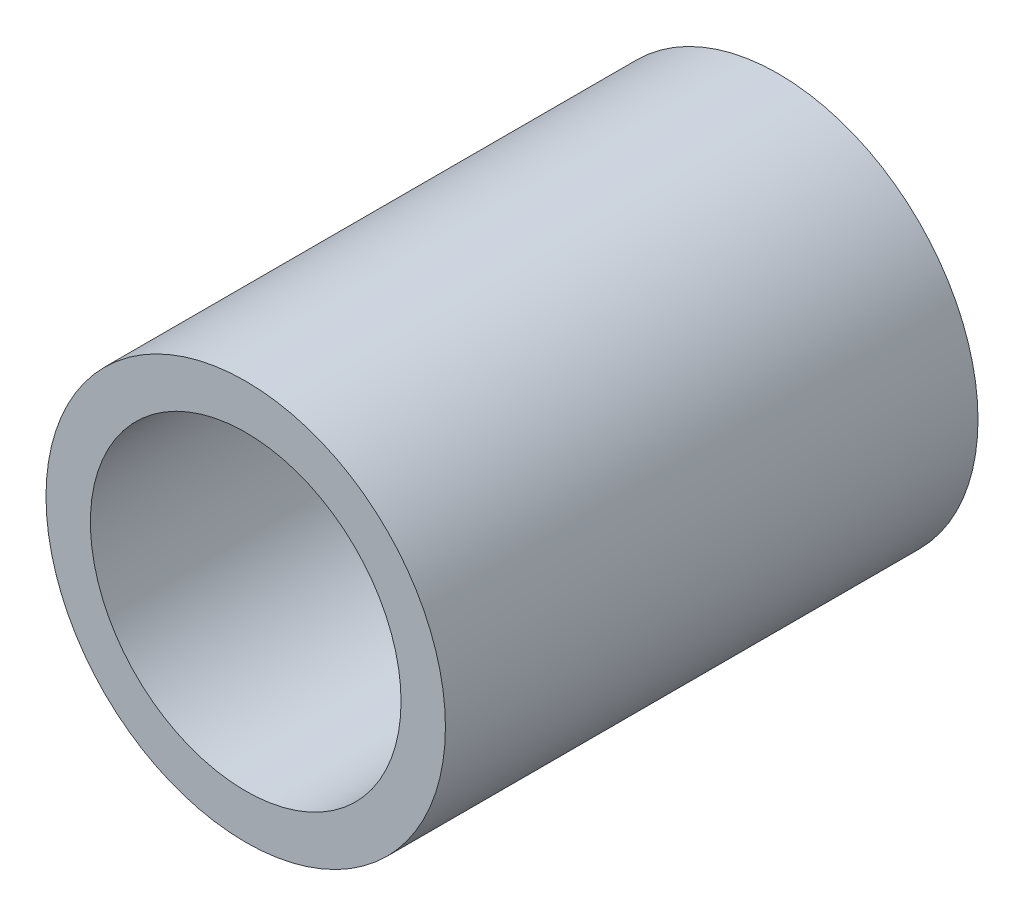
ISO-10303-21;
HEADER;
FILE_DESCRIPTION(('STEP AP214'),'2;1');
FILE_NAME('part.step','',(''),(''),'','','');
FILE_SCHEMA(('AUTOMOTIVE_DESIGN { 1 0 10303 214 1 1 1 1 }'));
ENDSEC;
DATA;
#1=APPLICATION_CONTEXT('core data for automotive mechanical design processes');
#2=APPLICATION_PROTOCOL_DEFINITION('international standard','automotive_design',2000,#1);
#3=PRODUCT_CONTEXT('',#1,'mechanical');
#4=PRODUCT('Part','Part','',(#3));
#5=PRODUCT_RELATED_PRODUCT_CATEGORY('part','',(#4));
#6=PRODUCT_DEFINITION_FORMATION('','',#4);
#7=PRODUCT_DEFINITION_CONTEXT('part definition',#1,'design');
#8=PRODUCT_DEFINITION('design','',#6,#7);
#9=PRODUCT_DEFINITION_SHAPE('','',#8);
#10=(LENGTH_UNIT() NAMED_UNIT(*) SI_UNIT(.MILLI.,.METRE.));
#11=(NAMED_UNIT(*) PLANE_ANGLE_UNIT() SI_UNIT($,.RADIAN.));
#12=(NAMED_UNIT(*) SI_UNIT($,.STERADIAN.) SOLID_ANGLE_UNIT());
#13=UNCERTAINTY_MEASURE_WITH_UNIT(LENGTH_MEASURE(1.E-05),#10,'distance_accuracy_value','');
#14=(GEOMETRIC_REPRESENTATION_CONTEXT(3) GLOBAL_UNCERTAINTY_ASSIGNED_CONTEXT((#13)) GLOBAL_UNIT_ASSIGNED_CONTEXT((#10,
#11,#12)) REPRESENTATION_CONTEXT('',''));
#15=CARTESIAN_POINT('',(0.,0.,0.));
#16=DIRECTION('',(0.,0.,1.));
#17=DIRECTION('',(1.,0.,0.));
#18=AXIS2_PLACEMENT_3D('',#15,#16,#17);
#19=CARTESIAN_POINT('',(0.,0.,36.));
#20=DIRECTION('',(0.,0.,1.));
#21=DIRECTION('',(1.,0.,0.));
#22=AXIS2_PLACEMENT_3D('',#19,#20,#21);
#23=PLANE('',#22);
#24=CARTESIAN_POINT('',(0.,0.,36.));
#25=DIRECTION('',(0.,0.,1.));
#26=DIRECTION('',(1.,0.,0.));
#27=AXIS2_PLACEMENT_3D('',#24,#25,#26);
#28=CIRCLE('',#27,27.);
#29=CARTESIAN_POINT('',(27.,0.,36.));
#30=VERTEX_POINT('',#29);
#31=EDGE_CURVE('E10',#30,#30,#28,.T.);
#32=ORIENTED_EDGE('',*,*,#31,.T.);
#33=EDGE_LOOP('',(#32));
#34=FACE_BOUND('',#33,.T.);
#35=CARTESIAN_POINT('',(0.,0.,36.));
#36=DIRECTION('',(0.,0.,1.));
#37=DIRECTION('',(1.,0.,0.));
#38=AXIS2_PLACEMENT_3D('',#35,#36,#37);
#39=CIRCLE('',#38,21.);
#40=CARTESIAN_POINT('',(21.,0.,36.));
#41=VERTEX_POINT('',#40);
#42=EDGE_CURVE('E50',#41,#41,#39,.T.);
#43=ORIENTED_EDGE('',*,*,#42,.F.);
#44=EDGE_LOOP('',(#43));
#45=FACE_BOUND('',#44,.T.);
#46=ADVANCED_FACE('F37',(#34,#45),#23,.T.);
#47=CARTESIAN_POINT('',(0.,0.,-36.));
#48=DIRECTION('',(0.,0.,1.));
#49=DIRECTION('',(1.,0.,0.));
#50=AXIS2_PLACEMENT_3D('',#47,#48,#49);
#51=PLANE('',#50);
#52=CARTESIAN_POINT('',(0.,0.,-36.));
#53=DIRECTION('',(0.,0.,1.));
#54=DIRECTION('',(1.,0.,0.));
#55=AXIS2_PLACEMENT_3D('',#52,#53,#54);
#56=CIRCLE('',#55,27.);
#57=CARTESIAN_POINT('',(27.,0.,-36.));
#58=VERTEX_POINT('',#57);
#59=EDGE_CURVE('E41',#58,#58,#56,.T.);
#60=ORIENTED_EDGE('',*,*,#59,.F.);
#61=EDGE_LOOP('',(#60));
#62=FACE_BOUND('',#61,.T.);
#63=CARTESIAN_POINT('',(0.,0.,-36.));
#64=DIRECTION('',(0.,0.,1.));
#65=DIRECTION('',(1.,0.,0.));
#66=AXIS2_PLACEMENT_3D('',#63,#64,#65);
#67=CIRCLE('',#66,21.);
#68=CARTESIAN_POINT('',(21.,0.,-36.));
#69=VERTEX_POINT('',#68);
#70=EDGE_CURVE('E52',#69,#69,#67,.T.);
#71=ORIENTED_EDGE('',*,*,#70,.T.);
#72=EDGE_LOOP('',(#71));
#73=FACE_BOUND('',#72,.T.);
#74=ADVANCED_FACE('F64',(#62,#73),#51,.F.);
#75=CARTESIAN_POINT('',(0.,0.,36.));
#76=DIRECTION('',(0.,0.,-1.));
#77=DIRECTION('',(-1.,0.,0.));
#78=AXIS2_PLACEMENT_3D('',#75,#76,#77);
#79=CYLINDRICAL_SURFACE('',#78,27.);
#80=ORIENTED_EDGE('',*,*,#31,.F.);
#81=EDGE_LOOP('',(#80));
#82=FACE_BOUND('',#81,.T.);
#83=ORIENTED_EDGE('',*,*,#59,.T.);
#84=EDGE_LOOP('',(#83));
#85=FACE_BOUND('',#84,.T.);
#86=ADVANCED_FACE('F39',(#82,#85),#79,.T.);
#87=CARTESIAN_POINT('',(0.,0.,36.));
#88=DIRECTION('',(0.,0.,-1.));
#89=DIRECTION('',(-1.,0.,0.));
#90=AXIS2_PLACEMENT_3D('',#87,#88,#89);
#91=CYLINDRICAL_SURFACE('',#90,21.);
#92=ORIENTED_EDGE('',*,*,#42,.T.);
#93=EDGE_LOOP('',(#92));
#94=FACE_BOUND('',#93,.T.);
#95=ORIENTED_EDGE('',*,*,#70,.F.);
#96=EDGE_LOOP('',(#95));
#97=FACE_BOUND('',#96,.T.);
#98=ADVANCED_FACE('F60',(#94,#97),#91,.F.);
#99=CLOSED_SHELL('',(#46,#74,#86,#98));
#100=MANIFOLD_SOLID_BREP('B2',#99);
#101=ADVANCED_BREP_SHAPE_REPRESENTATION('',(#18,#100),#14);
#102=SHAPE_DEFINITION_REPRESENTATION(#9,#101);
ENDSEC;
END-ISO-10303-21;
